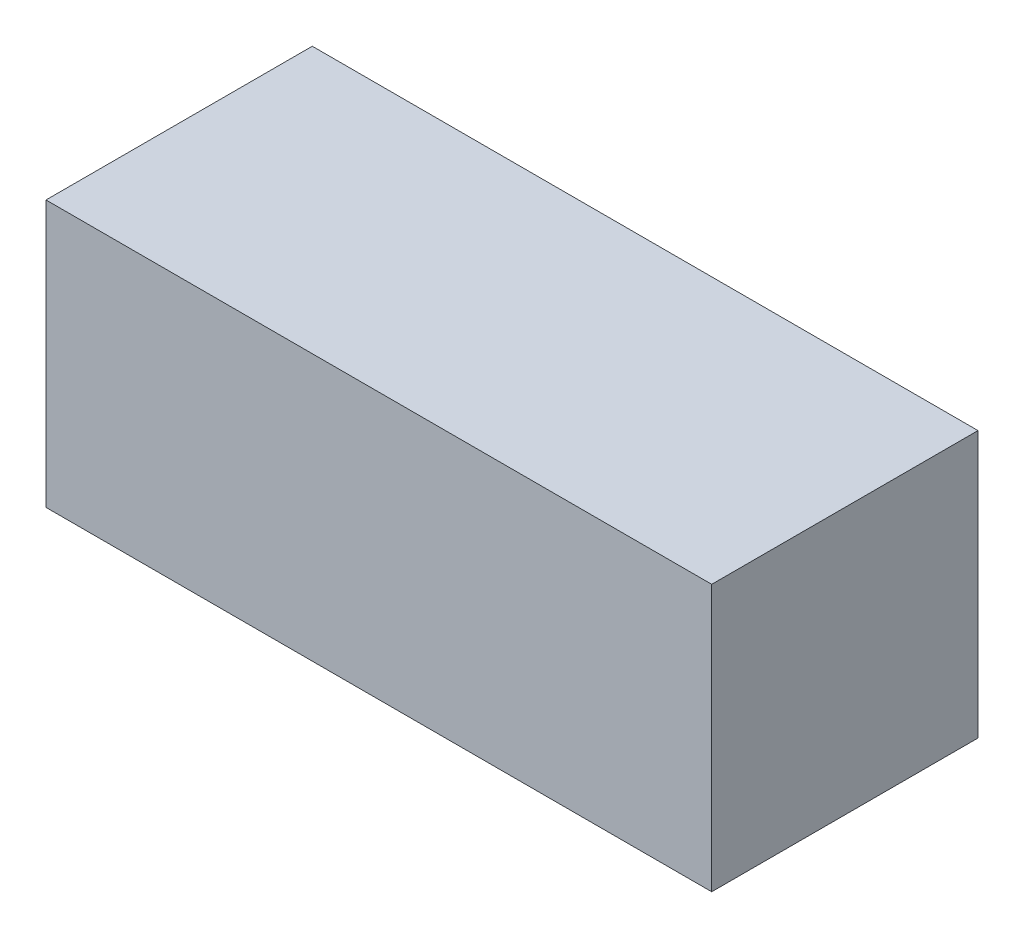
ISO-10303-21;
HEADER;
FILE_DESCRIPTION(('STEP AP214'),'2;1');
FILE_NAME('part.step','',(''),(''),'','','');
FILE_SCHEMA(('AUTOMOTIVE_DESIGN { 1 0 10303 214 1 1 1 1 }'));
ENDSEC;
DATA;
#1=APPLICATION_CONTEXT('core data for automotive mechanical design processes');
#2=APPLICATION_PROTOCOL_DEFINITION('international standard','automotive_design',2000,#1);
#3=PRODUCT_CONTEXT('',#1,'mechanical');
#4=PRODUCT('Part','Part','',(#3));
#5=PRODUCT_RELATED_PRODUCT_CATEGORY('part','',(#4));
#6=PRODUCT_DEFINITION_FORMATION('','',#4);
#7=PRODUCT_DEFINITION_CONTEXT('part definition',#1,'design');
#8=PRODUCT_DEFINITION('design','',#6,#7);
#9=PRODUCT_DEFINITION_SHAPE('','',#8);
#10=(LENGTH_UNIT() NAMED_UNIT(*) SI_UNIT(.MILLI.,.METRE.));
#11=(NAMED_UNIT(*) PLANE_ANGLE_UNIT() SI_UNIT($,.RADIAN.));
#12=(NAMED_UNIT(*) SI_UNIT($,.STERADIAN.) SOLID_ANGLE_UNIT());
#13=UNCERTAINTY_MEASURE_WITH_UNIT(LENGTH_MEASURE(1.E-05),#10,'distance_accuracy_value','');
#14=(GEOMETRIC_REPRESENTATION_CONTEXT(3) GLOBAL_UNCERTAINTY_ASSIGNED_CONTEXT((#13)) GLOBAL_UNIT_ASSIGNED_CONTEXT((#10,
#11,#12)) REPRESENTATION_CONTEXT('',''));
#15=CARTESIAN_POINT('',(0.,0.,0.));
#16=DIRECTION('',(0.,0.,1.));
#17=DIRECTION('',(1.,0.,0.));
#18=AXIS2_PLACEMENT_3D('',#15,#16,#17);
#19=CARTESIAN_POINT('',(-11.3782051282051,8.76299913168554,10.));
#20=DIRECTION('',(1.,0.,0.));
#21=DIRECTION('',(0.,1.,0.));
#22=AXIS2_PLACEMENT_3D('',#19,#20,#21);
#23=PLANE('',#22);
#24=DIRECTION('',(0.,-1.,0.));
#25=VECTOR('',#24,1.);
#26=CARTESIAN_POINT('',(-11.3782051282051,8.76299913168554,0.));
#27=LINE('',#26,#25);
#28=CARTESIAN_POINT('',(-11.3782051282051,8.76299913168554,0.));
#29=VERTEX_POINT('',#28);
#30=CARTESIAN_POINT('',(-11.3782051282051,-1.23700086831446,0.));
#31=VERTEX_POINT('',#30);
#32=EDGE_CURVE('E97',#29,#31,#27,.T.);
#33=ORIENTED_EDGE('',*,*,#32,.T.);
#34=DIRECTION('',(0.,0.,-1.));
#35=VECTOR('',#34,1.);
#36=CARTESIAN_POINT('',(-11.3782051282051,-1.23700086831446,10.));
#37=LINE('',#36,#35);
#38=CARTESIAN_POINT('',(-11.3782051282051,-1.23700086831446,10.));
#39=VERTEX_POINT('',#38);
#40=EDGE_CURVE('E11',#39,#31,#37,.T.);
#41=ORIENTED_EDGE('',*,*,#40,.F.);
#42=DIRECTION('',(0.,-1.,0.));
#43=VECTOR('',#42,1.);
#44=CARTESIAN_POINT('',(-11.3782051282051,8.76299913168554,10.));
#45=LINE('',#44,#43);
#46=CARTESIAN_POINT('',(-11.3782051282051,8.76299913168554,10.));
#47=VERTEX_POINT('',#46);
#48=EDGE_CURVE('E85',#47,#39,#45,.T.);
#49=ORIENTED_EDGE('',*,*,#48,.F.);
#50=DIRECTION('',(0.,0.,-1.));
#51=VECTOR('',#50,1.);
#52=CARTESIAN_POINT('',(-11.3782051282051,8.76299913168554,10.));
#53=LINE('',#52,#51);
#54=EDGE_CURVE('E93',#47,#29,#53,.T.);
#55=ORIENTED_EDGE('',*,*,#54,.T.);
#56=EDGE_LOOP('',(#33,#41,#49,#55));
#57=FACE_BOUND('',#56,.T.);
#58=ADVANCED_FACE('F34',(#57),#23,.F.);
#59=CARTESIAN_POINT('',(-11.3782051282051,-1.23700086831446,10.));
#60=DIRECTION('',(0.,1.,0.));
#61=DIRECTION('',(0.,0.,1.));
#62=AXIS2_PLACEMENT_3D('',#59,#60,#61);
#63=PLANE('',#62);
#64=DIRECTION('',(1.,0.,0.));
#65=VECTOR('',#64,1.);
#66=CARTESIAN_POINT('',(-11.3782051282051,-1.23700086831446,0.));
#67=LINE('',#66,#65);
#68=CARTESIAN_POINT('',(13.6217948717949,-1.23700086831446,0.));
#69=VERTEX_POINT('',#68);
#70=EDGE_CURVE('E89',#31,#69,#67,.T.);
#71=ORIENTED_EDGE('',*,*,#70,.T.);
#72=DIRECTION('',(0.,0.,-1.));
#73=VECTOR('',#72,1.);
#74=CARTESIAN_POINT('',(13.6217948717949,-1.23700086831446,10.));
#75=LINE('',#74,#73);
#76=CARTESIAN_POINT('',(13.6217948717949,-1.23700086831446,10.));
#77=VERTEX_POINT('',#76);
#78=EDGE_CURVE('E42',#77,#69,#75,.T.);
#79=ORIENTED_EDGE('',*,*,#78,.F.);
#80=DIRECTION('',(1.,0.,0.));
#81=VECTOR('',#80,1.);
#82=CARTESIAN_POINT('',(-11.3782051282051,-1.23700086831446,10.));
#83=LINE('',#82,#81);
#84=EDGE_CURVE('E80',#39,#77,#83,.T.);
#85=ORIENTED_EDGE('',*,*,#84,.F.);
#86=ORIENTED_EDGE('',*,*,#40,.T.);
#87=EDGE_LOOP('',(#71,#79,#85,#86));
#88=FACE_BOUND('',#87,.T.);
#89=ADVANCED_FACE('F88',(#88),#63,.F.);
#90=CARTESIAN_POINT('',(13.6217948717949,8.76299913168554,10.));
#91=DIRECTION('',(-1.,0.,0.));
#92=DIRECTION('',(0.,-1.,0.));
#93=AXIS2_PLACEMENT_3D('',#90,#91,#92);
#94=PLANE('',#93);
#95=DIRECTION('',(0.,1.,0.));
#96=VECTOR('',#95,1.);
#97=CARTESIAN_POINT('',(13.6217948717949,8.76299913168554,0.));
#98=LINE('',#97,#96);
#99=CARTESIAN_POINT('',(13.6217948717949,8.76299913168554,0.));
#100=VERTEX_POINT('',#99);
#101=EDGE_CURVE('E67',#69,#100,#98,.T.);
#102=ORIENTED_EDGE('',*,*,#101,.T.);
#103=DIRECTION('',(0.,0.,-1.));
#104=VECTOR('',#103,1.);
#105=CARTESIAN_POINT('',(13.6217948717949,8.76299913168554,10.));
#106=LINE('',#105,#104);
#107=CARTESIAN_POINT('',(13.6217948717949,8.76299913168554,10.));
#108=VERTEX_POINT('',#107);
#109=EDGE_CURVE('E90',#108,#100,#106,.T.);
#110=ORIENTED_EDGE('',*,*,#109,.F.);
#111=DIRECTION('',(0.,1.,0.));
#112=VECTOR('',#111,1.);
#113=CARTESIAN_POINT('',(13.6217948717949,8.76299913168554,10.));
#114=LINE('',#113,#112);
#115=EDGE_CURVE('E83',#77,#108,#114,.T.);
#116=ORIENTED_EDGE('',*,*,#115,.F.);
#117=ORIENTED_EDGE('',*,*,#78,.T.);
#118=EDGE_LOOP('',(#102,#110,#116,#117));
#119=FACE_BOUND('',#118,.T.);
#120=ADVANCED_FACE('F91',(#119),#94,.F.);
#121=CARTESIAN_POINT('',(-11.3782051282051,8.76299913168554,10.));
#122=DIRECTION('',(0.,-1.,0.));
#123=DIRECTION('',(0.,0.,-1.));
#124=AXIS2_PLACEMENT_3D('',#121,#122,#123);
#125=PLANE('',#124);
#126=DIRECTION('',(-1.,0.,0.));
#127=VECTOR('',#126,1.);
#128=CARTESIAN_POINT('',(-11.3782051282051,8.76299913168554,0.));
#129=LINE('',#128,#127);
#130=EDGE_CURVE('E73',#100,#29,#129,.T.);
#131=ORIENTED_EDGE('',*,*,#130,.T.);
#132=ORIENTED_EDGE('',*,*,#54,.F.);
#133=DIRECTION('',(-1.,0.,0.));
#134=VECTOR('',#133,1.);
#135=CARTESIAN_POINT('',(-11.3782051282051,8.76299913168554,10.));
#136=LINE('',#135,#134);
#137=EDGE_CURVE('E50',#108,#47,#136,.T.);
#138=ORIENTED_EDGE('',*,*,#137,.F.);
#139=ORIENTED_EDGE('',*,*,#109,.T.);
#140=EDGE_LOOP('',(#131,#132,#138,#139));
#141=FACE_BOUND('',#140,.T.);
#142=ADVANCED_FACE('F104',(#141),#125,.F.);
#143=CARTESIAN_POINT('',(0.,0.,10.));
#144=DIRECTION('',(0.,0.,1.));
#145=DIRECTION('',(1.,0.,0.));
#146=AXIS2_PLACEMENT_3D('',#143,#144,#145);
#147=PLANE('',#146);
#148=ORIENTED_EDGE('',*,*,#48,.T.);
#149=ORIENTED_EDGE('',*,*,#84,.T.);
#150=ORIENTED_EDGE('',*,*,#115,.T.);
#151=ORIENTED_EDGE('',*,*,#137,.T.);
#152=EDGE_LOOP('',(#148,#149,#150,#151));
#153=FACE_BOUND('',#152,.T.);
#154=ADVANCED_FACE('F81',(#153),#147,.T.);
#155=CARTESIAN_POINT('',(0.,0.,0.));
#156=DIRECTION('',(0.,0.,1.));
#157=DIRECTION('',(1.,0.,0.));
#158=AXIS2_PLACEMENT_3D('',#155,#156,#157);
#159=PLANE('',#158);
#160=ORIENTED_EDGE('',*,*,#32,.F.);
#161=ORIENTED_EDGE('',*,*,#130,.F.);
#162=ORIENTED_EDGE('',*,*,#101,.F.);
#163=ORIENTED_EDGE('',*,*,#70,.F.);
#164=EDGE_LOOP('',(#160,#161,#162,#163));
#165=FACE_BOUND('',#164,.T.);
#166=ADVANCED_FACE('F107',(#165),#159,.F.);
#167=CLOSED_SHELL('',(#58,#89,#120,#142,#154,#166));
#168=MANIFOLD_SOLID_BREP('B2',#167);
#169=ADVANCED_BREP_SHAPE_REPRESENTATION('',(#18,#168),#14);
#170=SHAPE_DEFINITION_REPRESENTATION(#9,#169);
ENDSEC;
END-ISO-10303-21;
